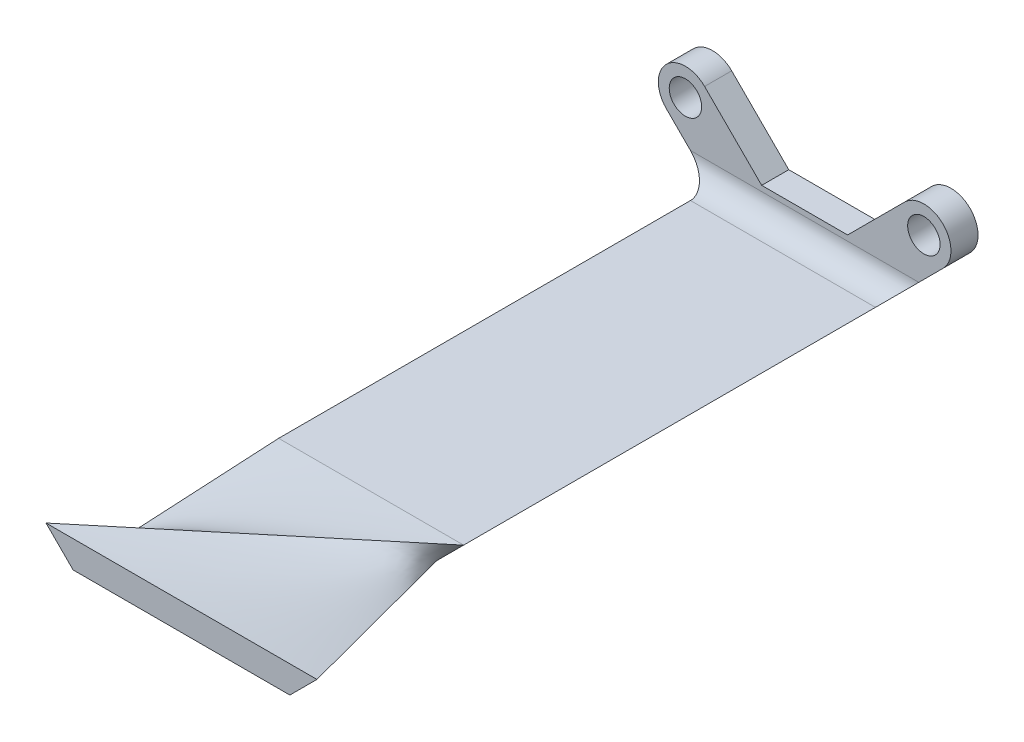
ISO-10303-21;
HEADER;
FILE_DESCRIPTION(('STEP AP214'),'2;1');
FILE_NAME('part.step','',(''),(''),'','','');
FILE_SCHEMA(('AUTOMOTIVE_DESIGN { 1 0 10303 214 1 1 1 1 }'));
ENDSEC;
DATA;
#1=APPLICATION_CONTEXT('core data for automotive mechanical design processes');
#2=APPLICATION_PROTOCOL_DEFINITION('international standard','automotive_design',2000,#1);
#3=PRODUCT_CONTEXT('',#1,'mechanical');
#4=PRODUCT('Part','Part','',(#3));
#5=PRODUCT_RELATED_PRODUCT_CATEGORY('part','',(#4));
#6=PRODUCT_DEFINITION_FORMATION('','',#4);
#7=PRODUCT_DEFINITION_CONTEXT('part definition',#1,'design');
#8=PRODUCT_DEFINITION('design','',#6,#7);
#9=PRODUCT_DEFINITION_SHAPE('','',#8);
#10=(LENGTH_UNIT() NAMED_UNIT(*) SI_UNIT(.MILLI.,.METRE.));
#11=(NAMED_UNIT(*) PLANE_ANGLE_UNIT() SI_UNIT($,.RADIAN.));
#12=(NAMED_UNIT(*) SI_UNIT($,.STERADIAN.) SOLID_ANGLE_UNIT());
#13=UNCERTAINTY_MEASURE_WITH_UNIT(LENGTH_MEASURE(1.E-05),#10,'distance_accuracy_value','');
#14=(GEOMETRIC_REPRESENTATION_CONTEXT(3) GLOBAL_UNCERTAINTY_ASSIGNED_CONTEXT((#13)) GLOBAL_UNIT_ASSIGNED_CONTEXT((#10,
#11,#12)) REPRESENTATION_CONTEXT('',''));
#15=CARTESIAN_POINT('',(0.,0.,0.));
#16=DIRECTION('',(0.,0.,1.));
#17=DIRECTION('',(1.,0.,0.));
#18=AXIS2_PLACEMENT_3D('',#15,#16,#17);
#19=CARTESIAN_POINT('',(0.,0.,3.175));
#20=DIRECTION('',(0.,0.,-1.));
#21=DIRECTION('',(-1.,0.,0.));
#22=AXIS2_PLACEMENT_3D('',#19,#20,#21);
#23=CYLINDRICAL_SURFACE('',#22,3.175);
#24=CARTESIAN_POINT('',(0.,0.,0.));
#25=DIRECTION('',(0.,0.,1.));
#26=DIRECTION('',(-1.,0.,0.));
#27=AXIS2_PLACEMENT_3D('',#24,#25,#26);
#28=CIRCLE('',#27,3.175);
#29=CARTESIAN_POINT('',(2.24506403026729,2.24506403026729,0.));
#30=VERTEX_POINT('',#29);
#31=CARTESIAN_POINT('',(-2.24506403026729,-2.24506403026729,0.));
#32=VERTEX_POINT('',#31);
#33=EDGE_CURVE('E90',#30,#32,#28,.T.);
#34=ORIENTED_EDGE('',*,*,#33,.T.);
#35=DIRECTION('',(0.,0.,-1.));
#36=VECTOR('',#35,1.);
#37=CARTESIAN_POINT('',(-2.24506403026729,-2.24506403026729,3.175));
#38=LINE('',#37,#36);
#39=CARTESIAN_POINT('',(-2.24506403026729,-2.24506403026729,3.175));
#40=VERTEX_POINT('',#39);
#41=EDGE_CURVE('E280',#40,#32,#38,.T.);
#42=ORIENTED_EDGE('',*,*,#41,.F.);
#43=CARTESIAN_POINT('',(0.,0.,3.175));
#44=DIRECTION('',(0.,0.,1.));
#45=DIRECTION('',(-1.,0.,0.));
#46=AXIS2_PLACEMENT_3D('',#43,#44,#45);
#47=CIRCLE('',#46,3.175);
#48=CARTESIAN_POINT('',(2.24506403026729,2.24506403026729,3.175));
#49=VERTEX_POINT('',#48);
#50=EDGE_CURVE('E267',#49,#40,#47,.T.);
#51=ORIENTED_EDGE('',*,*,#50,.F.);
#52=DIRECTION('',(0.,0.,-1.));
#53=VECTOR('',#52,1.);
#54=CARTESIAN_POINT('',(2.24506403026729,2.24506403026729,3.175));
#55=LINE('',#54,#53);
#56=EDGE_CURVE('E334',#49,#30,#55,.T.);
#57=ORIENTED_EDGE('',*,*,#56,.T.);
#58=EDGE_LOOP('',(#34,#42,#51,#57));
#59=FACE_BOUND('',#58,.T.);
#60=ADVANCED_FACE('F43',(#59),#23,.T.);
#61=CARTESIAN_POINT('',(-2.24506403026729,-2.24506403026729,3.175));
#62=DIRECTION('',(0.707106781186547,0.707106781186548,0.));
#63=DIRECTION('',(-0.707106781186548,0.707106781186547,0.));
#64=AXIS2_PLACEMENT_3D('',#61,#62,#63);
#65=PLANE('',#64);
#66=DIRECTION('',(0.707106781186548,-0.707106781186547,0.));
#67=VECTOR('',#66,1.);
#68=CARTESIAN_POINT('',(-2.24506403026729,-2.24506403026729,0.));
#69=LINE('',#68,#67);
#70=CARTESIAN_POINT('',(6.30487193946542,-10.795,0.));
#71=VERTEX_POINT('',#70);
#72=EDGE_CURVE('E308',#32,#71,#69,.T.);
#73=ORIENTED_EDGE('',*,*,#72,.T.);
#74=DIRECTION('',(0.,0.,-1.));
#75=VECTOR('',#74,1.);
#76=CARTESIAN_POINT('',(6.30487193946542,-10.795,3.175));
#77=LINE('',#76,#75);
#78=CARTESIAN_POINT('',(6.30487193946542,-10.795,53.975));
#79=VERTEX_POINT('',#78);
#80=EDGE_CURVE('E293',#79,#71,#77,.T.);
#81=ORIENTED_EDGE('',*,*,#80,.F.);
#82=DIRECTION('',(-0.707106781186548,0.707106781186547,0.));
#83=VECTOR('',#82,1.);
#84=CARTESIAN_POINT('',(-2.24506403026729,-2.24506403026729,53.975));
#85=LINE('',#84,#83);
#86=CARTESIAN_POINT('',(3.12987193946543,-7.62,53.975));
#87=VERTEX_POINT('',#86);
#88=EDGE_CURVE('E102',#87,#79,#85,.F.);
#89=ORIENTED_EDGE('',*,*,#88,.F.);
#90=DIRECTION('',(0.,0.,-1.));
#91=VECTOR('',#90,1.);
#92=CARTESIAN_POINT('',(3.12987193946543,-7.62,53.975));
#93=LINE('',#92,#91);
#94=CARTESIAN_POINT('',(3.12987193946543,-7.62,5.715));
#95=VERTEX_POINT('',#94);
#96=EDGE_CURVE('E91',#87,#95,#93,.T.);
#97=ORIENTED_EDGE('',*,*,#96,.T.);
#98=CARTESIAN_POINT('',(0.589871939465422,-5.08,5.715));
#99=DIRECTION('',(0.707106781186547,0.707106781186548,0.));
#100=DIRECTION('',(0.707106781186548,-0.707106781186547,0.));
#101=AXIS2_PLACEMENT_3D('',#98,#99,#100);
#102=ELLIPSE('',#101,3.59210244842766,2.54);
#103=CARTESIAN_POINT('',(0.589871939465422,-5.08,3.175));
#104=VERTEX_POINT('',#103);
#105=EDGE_CURVE('E12',#95,#104,#102,.T.);
#106=ORIENTED_EDGE('',*,*,#105,.T.);
#107=DIRECTION('',(0.707106781186548,-0.707106781186547,0.));
#108=VECTOR('',#107,1.);
#109=CARTESIAN_POINT('',(-2.24506403026729,-2.24506403026729,3.175));
#110=LINE('',#109,#108);
#111=EDGE_CURVE('E270',#40,#104,#110,.T.);
#112=ORIENTED_EDGE('',*,*,#111,.F.);
#113=ORIENTED_EDGE('',*,*,#41,.T.);
#114=EDGE_LOOP('',(#73,#81,#89,#97,#106,#112,#113));
#115=FACE_BOUND('',#114,.T.);
#116=ADVANCED_FACE('F303',(#115),#65,.F.);
#117=CARTESIAN_POINT('',(6.30487193946542,-10.795,3.175));
#118=DIRECTION('',(0.,1.,0.));
#119=DIRECTION('',(0.,0.,1.));
#120=AXIS2_PLACEMENT_3D('',#117,#118,#119);
#121=PLANE('',#120);
#122=DIRECTION('',(1.,0.,0.));
#123=VECTOR('',#122,1.);
#124=CARTESIAN_POINT('',(6.30487193946542,-10.795,0.));
#125=LINE('',#124,#123);
#126=CARTESIAN_POINT('',(21.6351280605346,-10.795,0.));
#127=VERTEX_POINT('',#126);
#128=EDGE_CURVE('E312',#71,#127,#125,.T.);
#129=ORIENTED_EDGE('',*,*,#128,.T.);
#130=DIRECTION('',(0.,0.,-1.));
#131=VECTOR('',#130,1.);
#132=CARTESIAN_POINT('',(21.6351280605346,-10.795,3.175));
#133=LINE('',#132,#131);
#134=CARTESIAN_POINT('',(21.6351280605346,-10.795,53.975));
#135=VERTEX_POINT('',#134);
#136=EDGE_CURVE('E80',#135,#127,#133,.T.);
#137=ORIENTED_EDGE('',*,*,#136,.F.);
#138=DIRECTION('',(1.,0.,0.));
#139=VECTOR('',#138,1.);
#140=CARTESIAN_POINT('',(6.30487193946542,-10.795,53.975));
#141=LINE('',#140,#139);
#142=EDGE_CURVE('E112',#79,#135,#141,.T.);
#143=ORIENTED_EDGE('',*,*,#142,.F.);
#144=ORIENTED_EDGE('',*,*,#80,.T.);
#145=EDGE_LOOP('',(#129,#137,#143,#144));
#146=FACE_BOUND('',#145,.T.);
#147=ADVANCED_FACE('F310',(#146),#121,.F.);
#148=CARTESIAN_POINT('',(21.6351280605346,-10.795,3.175));
#149=DIRECTION('',(-0.707106781186547,0.707106781186548,0.));
#150=DIRECTION('',(-0.707106781186548,-0.707106781186547,0.));
#151=AXIS2_PLACEMENT_3D('',#148,#149,#150);
#152=PLANE('',#151);
#153=DIRECTION('',(0.707106781186548,0.707106781186547,0.));
#154=VECTOR('',#153,1.);
#155=CARTESIAN_POINT('',(21.6351280605346,-10.795,0.));
#156=LINE('',#155,#154);
#157=CARTESIAN_POINT('',(30.1850640302673,-2.24506403026729,0.));
#158=VERTEX_POINT('',#157);
#159=EDGE_CURVE('E345',#127,#158,#156,.T.);
#160=ORIENTED_EDGE('',*,*,#159,.T.);
#161=DIRECTION('',(0.,0.,-1.));
#162=VECTOR('',#161,1.);
#163=CARTESIAN_POINT('',(30.1850640302673,-2.24506403026729,3.175));
#164=LINE('',#163,#162);
#165=CARTESIAN_POINT('',(30.1850640302673,-2.24506403026729,3.175));
#166=VERTEX_POINT('',#165);
#167=EDGE_CURVE('E297',#166,#158,#164,.T.);
#168=ORIENTED_EDGE('',*,*,#167,.F.);
#169=DIRECTION('',(0.707106781186548,0.707106781186547,0.));
#170=VECTOR('',#169,1.);
#171=CARTESIAN_POINT('',(21.6351280605346,-10.795,3.175));
#172=LINE('',#171,#170);
#173=CARTESIAN_POINT('',(27.3501280605346,-5.08,3.175));
#174=VERTEX_POINT('',#173);
#175=EDGE_CURVE('E279',#174,#166,#172,.T.);
#176=ORIENTED_EDGE('',*,*,#175,.F.);
#177=CARTESIAN_POINT('',(27.3501280605346,-5.08,5.715));
#178=DIRECTION('',(-0.707106781186547,0.707106781186548,0.));
#179=DIRECTION('',(0.707106781186548,0.707106781186547,0.));
#180=AXIS2_PLACEMENT_3D('',#177,#178,#179);
#181=ELLIPSE('',#180,3.59210244842766,2.54);
#182=CARTESIAN_POINT('',(24.8101280605346,-7.62,5.715));
#183=VERTEX_POINT('',#182);
#184=EDGE_CURVE('E53',#174,#183,#181,.T.);
#185=ORIENTED_EDGE('',*,*,#184,.T.);
#186=DIRECTION('',(0.,0.,-1.));
#187=VECTOR('',#186,1.);
#188=CARTESIAN_POINT('',(24.8101280605346,-7.62,53.975));
#189=LINE('',#188,#187);
#190=CARTESIAN_POINT('',(24.8101280605346,-7.62,53.975));
#191=VERTEX_POINT('',#190);
#192=EDGE_CURVE('E82',#191,#183,#189,.T.);
#193=ORIENTED_EDGE('',*,*,#192,.F.);
#194=DIRECTION('',(-0.707106781186548,-0.707106781186547,0.));
#195=VECTOR('',#194,1.);
#196=CARTESIAN_POINT('',(21.6351280605346,-10.795,53.975));
#197=LINE('',#196,#195);
#198=EDGE_CURVE('E47',#135,#191,#197,.F.);
#199=ORIENTED_EDGE('',*,*,#198,.F.);
#200=ORIENTED_EDGE('',*,*,#136,.T.);
#201=EDGE_LOOP('',(#160,#168,#176,#185,#193,#199,#200));
#202=FACE_BOUND('',#201,.T.);
#203=ADVANCED_FACE('F85',(#202),#152,.F.);
#204=CARTESIAN_POINT('',(27.94,0.,3.175));
#205=DIRECTION('',(0.,0.,-1.));
#206=DIRECTION('',(-1.,0.,0.));
#207=AXIS2_PLACEMENT_3D('',#204,#205,#206);
#208=CYLINDRICAL_SURFACE('',#207,3.175);
#209=CARTESIAN_POINT('',(27.94,0.,0.));
#210=DIRECTION('',(0.,0.,1.));
#211=DIRECTION('',(1.,0.,0.));
#212=AXIS2_PLACEMENT_3D('',#209,#210,#211);
#213=CIRCLE('',#212,3.175);
#214=CARTESIAN_POINT('',(25.6949359697327,2.24506403026729,0.));
#215=VERTEX_POINT('',#214);
#216=EDGE_CURVE('E347',#158,#215,#213,.T.);
#217=ORIENTED_EDGE('',*,*,#216,.T.);
#218=DIRECTION('',(0.,0.,-1.));
#219=VECTOR('',#218,1.);
#220=CARTESIAN_POINT('',(25.6949359697327,2.24506403026729,3.175));
#221=LINE('',#220,#219);
#222=CARTESIAN_POINT('',(25.6949359697327,2.24506403026729,3.175));
#223=VERTEX_POINT('',#222);
#224=EDGE_CURVE('E365',#223,#215,#221,.T.);
#225=ORIENTED_EDGE('',*,*,#224,.F.);
#226=CARTESIAN_POINT('',(27.94,0.,3.175));
#227=DIRECTION('',(0.,0.,1.));
#228=DIRECTION('',(1.,0.,0.));
#229=AXIS2_PLACEMENT_3D('',#226,#227,#228);
#230=CIRCLE('',#229,3.175);
#231=EDGE_CURVE('E286',#166,#223,#230,.T.);
#232=ORIENTED_EDGE('',*,*,#231,.F.);
#233=ORIENTED_EDGE('',*,*,#167,.T.);
#234=EDGE_LOOP('',(#217,#225,#232,#233));
#235=FACE_BOUND('',#234,.T.);
#236=ADVANCED_FACE('F319',(#235),#208,.T.);
#237=CARTESIAN_POINT('',(19.0048719394654,-4.445,3.175));
#238=DIRECTION('',(0.707106781186548,-0.707106781186547,0.));
#239=DIRECTION('',(0.707106781186547,0.707106781186548,0.));
#240=AXIS2_PLACEMENT_3D('',#237,#238,#239);
#241=PLANE('',#240);
#242=DIRECTION('',(-0.707106781186547,-0.707106781186548,0.));
#243=VECTOR('',#242,1.);
#244=CARTESIAN_POINT('',(19.0048719394654,-4.445,0.));
#245=LINE('',#244,#243);
#246=CARTESIAN_POINT('',(19.0048719394654,-4.445,0.));
#247=VERTEX_POINT('',#246);
#248=EDGE_CURVE('E350',#215,#247,#245,.T.);
#249=ORIENTED_EDGE('',*,*,#248,.T.);
#250=DIRECTION('',(0.,0.,-1.));
#251=VECTOR('',#250,1.);
#252=CARTESIAN_POINT('',(19.0048719394654,-4.445,3.175));
#253=LINE('',#252,#251);
#254=CARTESIAN_POINT('',(19.0048719394654,-4.445,3.175));
#255=VERTEX_POINT('',#254);
#256=EDGE_CURVE('E362',#255,#247,#253,.T.);
#257=ORIENTED_EDGE('',*,*,#256,.F.);
#258=DIRECTION('',(-0.707106781186547,-0.707106781186548,0.));
#259=VECTOR('',#258,1.);
#260=CARTESIAN_POINT('',(19.0048719394654,-4.445,3.175));
#261=LINE('',#260,#259);
#262=EDGE_CURVE('E404',#223,#255,#261,.T.);
#263=ORIENTED_EDGE('',*,*,#262,.F.);
#264=ORIENTED_EDGE('',*,*,#224,.T.);
#265=EDGE_LOOP('',(#249,#257,#263,#264));
#266=FACE_BOUND('',#265,.T.);
#267=ADVANCED_FACE('F386',(#266),#241,.F.);
#268=CARTESIAN_POINT('',(8.93512806053458,-4.445,3.175));
#269=DIRECTION('',(0.,-1.,0.));
#270=DIRECTION('',(0.,0.,-1.));
#271=AXIS2_PLACEMENT_3D('',#268,#269,#270);
#272=PLANE('',#271);
#273=DIRECTION('',(-1.,0.,0.));
#274=VECTOR('',#273,1.);
#275=CARTESIAN_POINT('',(8.93512806053458,-4.445,0.));
#276=LINE('',#275,#274);
#277=CARTESIAN_POINT('',(8.93512806053458,-4.445,0.));
#278=VERTEX_POINT('',#277);
#279=EDGE_CURVE('E353',#247,#278,#276,.T.);
#280=ORIENTED_EDGE('',*,*,#279,.T.);
#281=DIRECTION('',(0.,0.,-1.));
#282=VECTOR('',#281,1.);
#283=CARTESIAN_POINT('',(8.93512806053458,-4.445,3.175));
#284=LINE('',#283,#282);
#285=CARTESIAN_POINT('',(8.93512806053458,-4.445,3.175));
#286=VERTEX_POINT('',#285);
#287=EDGE_CURVE('E359',#286,#278,#284,.T.);
#288=ORIENTED_EDGE('',*,*,#287,.F.);
#289=DIRECTION('',(-1.,0.,0.));
#290=VECTOR('',#289,1.);
#291=CARTESIAN_POINT('',(8.93512806053458,-4.445,3.175));
#292=LINE('',#291,#290);
#293=EDGE_CURVE('E396',#255,#286,#292,.T.);
#294=ORIENTED_EDGE('',*,*,#293,.F.);
#295=ORIENTED_EDGE('',*,*,#256,.T.);
#296=EDGE_LOOP('',(#280,#288,#294,#295));
#297=FACE_BOUND('',#296,.T.);
#298=ADVANCED_FACE('F393',(#297),#272,.F.);
#299=CARTESIAN_POINT('',(2.24506403026729,2.24506403026729,3.175));
#300=DIRECTION('',(-0.707106781186548,-0.707106781186548,0.));
#301=DIRECTION('',(0.707106781186548,-0.707106781186548,0.));
#302=AXIS2_PLACEMENT_3D('',#299,#300,#301);
#303=PLANE('',#302);
#304=DIRECTION('',(-0.707106781186547,0.707106781186547,0.));
#305=VECTOR('',#304,1.);
#306=CARTESIAN_POINT('',(2.24506403026729,2.24506403026729,0.));
#307=LINE('',#306,#305);
#308=EDGE_CURVE('E271',#278,#30,#307,.T.);
#309=ORIENTED_EDGE('',*,*,#308,.T.);
#310=ORIENTED_EDGE('',*,*,#56,.F.);
#311=DIRECTION('',(-0.707106781186547,0.707106781186547,0.));
#312=VECTOR('',#311,1.);
#313=CARTESIAN_POINT('',(2.24506403026729,2.24506403026729,3.175));
#314=LINE('',#313,#312);
#315=EDGE_CURVE('E341',#286,#49,#314,.T.);
#316=ORIENTED_EDGE('',*,*,#315,.F.);
#317=ORIENTED_EDGE('',*,*,#287,.T.);
#318=EDGE_LOOP('',(#309,#310,#316,#317));
#319=FACE_BOUND('',#318,.T.);
#320=ADVANCED_FACE('F427',(#319),#303,.F.);
#321=CARTESIAN_POINT('',(0.,0.,3.175));
#322=DIRECTION('',(0.,0.,-1.));
#323=DIRECTION('',(-1.,0.,0.));
#324=AXIS2_PLACEMENT_3D('',#321,#322,#323);
#325=PLANE('',#324);
#326=CARTESIAN_POINT('',(27.94,0.,3.175));
#327=DIRECTION('',(0.,0.,-1.));
#328=DIRECTION('',(-1.,0.,0.));
#329=AXIS2_PLACEMENT_3D('',#326,#327,#328);
#330=CIRCLE('',#329,1.89864999999999);
#331=CARTESIAN_POINT('',(26.04135,0.,3.175));
#332=VERTEX_POINT('',#331);
#333=EDGE_CURVE('E258',#332,#332,#330,.T.);
#334=ORIENTED_EDGE('',*,*,#333,.T.);
#335=EDGE_LOOP('',(#334));
#336=FACE_BOUND('',#335,.T.);
#337=CARTESIAN_POINT('',(0.,0.,3.175));
#338=DIRECTION('',(0.,0.,-1.));
#339=DIRECTION('',(-1.,0.,0.));
#340=AXIS2_PLACEMENT_3D('',#337,#338,#339);
#341=CIRCLE('',#340,1.89864999999999);
#342=CARTESIAN_POINT('',(-1.89864999999999,0.,3.175));
#343=VERTEX_POINT('',#342);
#344=EDGE_CURVE('E264',#343,#343,#341,.T.);
#345=ORIENTED_EDGE('',*,*,#344,.T.);
#346=EDGE_LOOP('',(#345));
#347=FACE_BOUND('',#346,.T.);
#348=ORIENTED_EDGE('',*,*,#111,.T.);
#349=DIRECTION('',(1.,0.,0.));
#350=VECTOR('',#349,1.);
#351=CARTESIAN_POINT('',(0.,-5.08,3.175));
#352=LINE('',#351,#350);
#353=EDGE_CURVE('E287',#104,#174,#352,.T.);
#354=ORIENTED_EDGE('',*,*,#353,.T.);
#355=ORIENTED_EDGE('',*,*,#175,.T.);
#356=ORIENTED_EDGE('',*,*,#231,.T.);
#357=ORIENTED_EDGE('',*,*,#262,.T.);
#358=ORIENTED_EDGE('',*,*,#293,.T.);
#359=ORIENTED_EDGE('',*,*,#315,.T.);
#360=ORIENTED_EDGE('',*,*,#50,.T.);
#361=EDGE_LOOP('',(#348,#354,#355,#356,#357,#358,#359,#360));
#362=FACE_BOUND('',#361,.T.);
#363=ADVANCED_FACE('F406',(#336,#347,#362),#325,.F.);
#364=CARTESIAN_POINT('',(0.,0.,0.));
#365=DIRECTION('',(0.,0.,-1.));
#366=DIRECTION('',(-1.,0.,0.));
#367=AXIS2_PLACEMENT_3D('',#364,#365,#366);
#368=PLANE('',#367);
#369=CARTESIAN_POINT('',(27.94,0.,0.));
#370=DIRECTION('',(0.,0.,-1.));
#371=DIRECTION('',(-1.,0.,0.));
#372=AXIS2_PLACEMENT_3D('',#369,#370,#371);
#373=CIRCLE('',#372,1.89864999999999);
#374=CARTESIAN_POINT('',(26.04135,0.,0.));
#375=VERTEX_POINT('',#374);
#376=EDGE_CURVE('E250',#375,#375,#373,.T.);
#377=ORIENTED_EDGE('',*,*,#376,.F.);
#378=EDGE_LOOP('',(#377));
#379=FACE_BOUND('',#378,.T.);
#380=CARTESIAN_POINT('',(0.,0.,0.));
#381=DIRECTION('',(0.,0.,-1.));
#382=DIRECTION('',(-1.,0.,0.));
#383=AXIS2_PLACEMENT_3D('',#380,#381,#382);
#384=CIRCLE('',#383,1.89864999999999);
#385=CARTESIAN_POINT('',(-1.89864999999999,0.,0.));
#386=VERTEX_POINT('',#385);
#387=EDGE_CURVE('E261',#386,#386,#384,.T.);
#388=ORIENTED_EDGE('',*,*,#387,.F.);
#389=EDGE_LOOP('',(#388));
#390=FACE_BOUND('',#389,.T.);
#391=ORIENTED_EDGE('',*,*,#33,.F.);
#392=ORIENTED_EDGE('',*,*,#308,.F.);
#393=ORIENTED_EDGE('',*,*,#279,.F.);
#394=ORIENTED_EDGE('',*,*,#248,.F.);
#395=ORIENTED_EDGE('',*,*,#216,.F.);
#396=ORIENTED_EDGE('',*,*,#159,.F.);
#397=ORIENTED_EDGE('',*,*,#128,.F.);
#398=ORIENTED_EDGE('',*,*,#72,.F.);
#399=EDGE_LOOP('',(#391,#392,#393,#394,#395,#396,#397,#398));
#400=FACE_BOUND('',#399,.T.);
#401=ADVANCED_FACE('F380',(#379,#390,#400),#368,.T.);
#402=CARTESIAN_POINT('',(13.97,-7.62,53.975));
#403=DIRECTION('',(0.,1.,0.));
#404=DIRECTION('',(0.,0.,1.));
#405=AXIS2_PLACEMENT_3D('',#402,#403,#404);
#406=PLANE('',#405);
#407=ORIENTED_EDGE('',*,*,#192,.T.);
#408=DIRECTION('',(1.,0.,0.));
#409=VECTOR('',#408,1.);
#410=CARTESIAN_POINT('',(13.97,-7.62,5.715));
#411=LINE('',#410,#409);
#412=EDGE_CURVE('E290',#183,#95,#411,.F.);
#413=ORIENTED_EDGE('',*,*,#412,.T.);
#414=ORIENTED_EDGE('',*,*,#96,.F.);
#415=DIRECTION('',(1.,0.,0.));
#416=VECTOR('',#415,1.);
#417=CARTESIAN_POINT('',(13.97,-7.62,53.975));
#418=LINE('',#417,#416);
#419=EDGE_CURVE('E94',#87,#191,#418,.T.);
#420=ORIENTED_EDGE('',*,*,#419,.T.);
#421=EDGE_LOOP('',(#407,#413,#414,#420));
#422=FACE_BOUND('',#421,.T.);
#423=ADVANCED_FACE('F95',(#422),#406,.T.);
#424=CARTESIAN_POINT('',(0.,-5.08,5.715));
#425=DIRECTION('',(1.,0.,0.));
#426=DIRECTION('',(0.,0.,-1.));
#427=AXIS2_PLACEMENT_3D('',#424,#425,#426);
#428=CYLINDRICAL_SURFACE('',#427,2.54);
#429=ORIENTED_EDGE('',*,*,#105,.F.);
#430=ORIENTED_EDGE('',*,*,#412,.F.);
#431=ORIENTED_EDGE('',*,*,#184,.F.);
#432=ORIENTED_EDGE('',*,*,#353,.F.);
#433=EDGE_LOOP('',(#429,#430,#431,#432));
#434=FACE_BOUND('',#433,.T.);
#435=ADVANCED_FACE('F45',(#434),#428,.F.);
#436=CARTESIAN_POINT('',(0.,0.,0.));
#437=DIRECTION('',(0.,0.,-1.));
#438=DIRECTION('',(-1.,0.,0.));
#439=AXIS2_PLACEMENT_3D('',#436,#437,#438);
#440=CYLINDRICAL_SURFACE('',#439,1.89864999999999);
#441=ORIENTED_EDGE('',*,*,#387,.T.);
#442=EDGE_LOOP('',(#441));
#443=FACE_BOUND('',#442,.T.);
#444=ORIENTED_EDGE('',*,*,#344,.F.);
#445=EDGE_LOOP('',(#444));
#446=FACE_BOUND('',#445,.T.);
#447=ADVANCED_FACE('F468',(#443,#446),#440,.F.);
#448=CARTESIAN_POINT('',(27.94,0.,0.));
#449=DIRECTION('',(0.,0.,-1.));
#450=DIRECTION('',(-1.,0.,0.));
#451=AXIS2_PLACEMENT_3D('',#448,#449,#450);
#452=CYLINDRICAL_SURFACE('',#451,1.89864999999999);
#453=ORIENTED_EDGE('',*,*,#376,.T.);
#454=EDGE_LOOP('',(#453));
#455=FACE_BOUND('',#454,.T.);
#456=ORIENTED_EDGE('',*,*,#333,.F.);
#457=EDGE_LOOP('',(#456));
#458=FACE_BOUND('',#457,.T.);
#459=ADVANCED_FACE('F224',(#455,#458),#452,.F.);
#460=CARTESIAN_POINT('',(13.97,-23.495,76.2));
#461=DIRECTION('',(0.,0.,-1.));
#462=DIRECTION('',(-1.,0.,0.));
#463=AXIS2_PLACEMENT_3D('',#460,#461,#462);
#464=PLANE('',#463);
#465=DIRECTION('',(0.707106781186547,-0.707106781186547,0.));
#466=VECTOR('',#465,1.);
#467=CARTESIAN_POINT('',(-1.905,-7.62,76.2));
#468=LINE('',#467,#466);
#469=CARTESIAN_POINT('',(-1.905,-7.62,76.2));
#470=VERTEX_POINT('',#469);
#471=CARTESIAN_POINT('',(1.27,-10.795,76.2));
#472=VERTEX_POINT('',#471);
#473=EDGE_CURVE('E116',#470,#472,#468,.T.);
#474=ORIENTED_EDGE('',*,*,#473,.T.);
#475=DIRECTION('',(1.,0.,0.));
#476=VECTOR('',#475,1.);
#477=CARTESIAN_POINT('',(1.27,-10.795,76.2));
#478=LINE('',#477,#476);
#479=CARTESIAN_POINT('',(26.67,-10.795,76.2));
#480=VERTEX_POINT('',#479);
#481=EDGE_CURVE('E238',#472,#480,#478,.T.);
#482=ORIENTED_EDGE('',*,*,#481,.T.);
#483=DIRECTION('',(0.707106781186547,0.707106781186547,0.));
#484=VECTOR('',#483,1.);
#485=CARTESIAN_POINT('',(29.845,-7.62,76.2));
#486=LINE('',#485,#484);
#487=CARTESIAN_POINT('',(29.845,-7.62,76.2));
#488=VERTEX_POINT('',#487);
#489=EDGE_CURVE('E189',#480,#488,#486,.T.);
#490=ORIENTED_EDGE('',*,*,#489,.T.);
#491=DIRECTION('',(-1.,0.,0.));
#492=VECTOR('',#491,1.);
#493=CARTESIAN_POINT('',(-1.905,-7.62,76.2));
#494=LINE('',#493,#492);
#495=EDGE_CURVE('E123',#488,#470,#494,.T.);
#496=ORIENTED_EDGE('',*,*,#495,.T.);
#497=EDGE_LOOP('',(#474,#482,#490,#496));
#498=FACE_BOUND('',#497,.T.);
#499=ADVANCED_FACE('F215',(#498),#464,.F.);
#500=CARTESIAN_POINT('',(6.30487193946542,-10.795,53.975));
#501=CARTESIAN_POINT('',(26.67,-10.795,76.2));
#502=CARTESIAN_POINT('',(8.85991462631028,-10.795,53.975));
#503=CARTESIAN_POINT('',(27.1991666666667,-10.2658333333333,76.2));
#504=CARTESIAN_POINT('',(11.4149573131551,-10.795,53.975));
#505=CARTESIAN_POINT('',(27.7283333333333,-9.73666666666666,76.2));
#506=CARTESIAN_POINT('',(16.5250426868449,-10.795,53.975));
#507=CARTESIAN_POINT('',(28.7866666666667,-8.67833333333333,76.2));
#508=CARTESIAN_POINT('',(19.0800853736897,-10.795,53.975));
#509=CARTESIAN_POINT('',(29.3158333333333,-8.14916666666666,76.2));
#510=CARTESIAN_POINT('',(21.6351280605346,-10.795,53.975));
#511=CARTESIAN_POINT('',(29.845,-7.62,76.2));
#512=B_SPLINE_SURFACE_WITH_KNOTS('',3,1,((#500,#501),(#502,#503),(#504,#505),(#506,#507),(#508,
#509),(#510,#511)),.UNSPECIFIED.,.F.,.F.,.F.,(4,2,4),(2,2),(0.,0.5,1.),(0.,1.),.UNSPECIFIED.);
#513=DIRECTION('',(0.343442178594856,0.132819235802802,0.929734650619616));
#514=VECTOR('',#513,1.);
#515=CARTESIAN_POINT('',(25.7400640302673,-9.2075,65.0875));
#516=LINE('',#515,#514);
#517=EDGE_CURVE('E111',#135,#488,#516,.T.);
#518=DIRECTION('',(-0.675584215743293,0.,-0.737282827304773));
#519=VECTOR('',#518,1.);
#520=CARTESIAN_POINT('',(16.4874359697327,-10.795,65.0875));
#521=LINE('',#520,#519);
#522=EDGE_CURVE('E118',#480,#79,#521,.T.);
#523=ORIENTED_EDGE('',*,*,#142,.T.);
#524=ORIENTED_EDGE('',*,*,#517,.T.);
#525=ORIENTED_EDGE('',*,*,#489,.F.);
#526=ORIENTED_EDGE('',*,*,#522,.T.);
#527=EDGE_LOOP('',(#523,#524,#525,#526));
#528=FACE_BOUND('',#527,.T.);
#529=ADVANCED_FACE('F151',(#528),#512,.T.);
#530=CARTESIAN_POINT('',(21.6351280605346,-10.795,53.975));
#531=CARTESIAN_POINT('',(29.845,-7.62,76.2));
#532=CARTESIAN_POINT('',(22.1642947272012,-10.2658333333333,53.975));
#533=CARTESIAN_POINT('',(24.5533333333333,-7.62,76.2));
#534=CARTESIAN_POINT('',(22.6934613938679,-9.73666666666667,53.975));
#535=CARTESIAN_POINT('',(19.2616666666666,-7.62,76.2));
#536=CARTESIAN_POINT('',(23.7517947272012,-8.67833333333333,53.975));
#537=CARTESIAN_POINT('',(8.67833333333324,-7.62,76.2));
#538=CARTESIAN_POINT('',(24.2809613938679,-8.14916666666667,53.975));
#539=CARTESIAN_POINT('',(3.3866666666666,-7.62,76.2));
#540=CARTESIAN_POINT('',(24.8101280605346,-7.62,53.975));
#541=CARTESIAN_POINT('',(-1.905,-7.62,76.2));
#542=B_SPLINE_SURFACE_WITH_KNOTS('',3,1,((#530,#531),(#532,#533),(#534,#535),(#536,#537),(#538,
#539),(#540,#541)),.UNSPECIFIED.,.F.,.F.,.F.,(4,2,4),(2,2),(0.,0.5,1.),(0.,1.),.UNSPECIFIED.);
#543=DIRECTION('',(-0.768753228419935,0.,0.639545521283613));
#544=VECTOR('',#543,1.);
#545=CARTESIAN_POINT('',(11.4525640302673,-7.62,65.0875));
#546=LINE('',#545,#544);
#547=EDGE_CURVE('E109',#191,#470,#546,.T.);
#548=ORIENTED_EDGE('',*,*,#198,.T.);
#549=ORIENTED_EDGE('',*,*,#547,.T.);
#550=ORIENTED_EDGE('',*,*,#495,.F.);
#551=ORIENTED_EDGE('',*,*,#517,.F.);
#552=EDGE_LOOP('',(#548,#549,#550,#551));
#553=FACE_BOUND('',#552,.T.);
#554=ADVANCED_FACE('F106',(#553),#542,.T.);
#555=CARTESIAN_POINT('',(3.12987193946543,-7.62,53.975));
#556=CARTESIAN_POINT('',(1.27,-10.795,76.2));
#557=CARTESIAN_POINT('',(3.65903860613209,-8.14916666666666,53.975));
#558=CARTESIAN_POINT('',(5.50333333333333,-10.795,76.2));
#559=CARTESIAN_POINT('',(4.18820527279876,-8.67833333333333,53.975));
#560=CARTESIAN_POINT('',(9.73666666666666,-10.795,76.2));
#561=CARTESIAN_POINT('',(5.24653860613209,-9.73666666666666,53.975));
#562=CARTESIAN_POINT('',(18.2033333333333,-10.795,76.2));
#563=CARTESIAN_POINT('',(5.77570527279876,-10.2658333333333,53.975));
#564=CARTESIAN_POINT('',(22.4366666666667,-10.795,76.2));
#565=CARTESIAN_POINT('',(6.30487193946543,-10.795,53.975));
#566=CARTESIAN_POINT('',(26.67,-10.795,76.2));
#567=B_SPLINE_SURFACE_WITH_KNOTS('',3,1,((#555,#556),(#557,#558),(#559,#560),(#561,#562),(#563,
#564),(#565,#566)),.UNSPECIFIED.,.F.,.F.,.F.,(4,2,4),(2,2),(0.,0.5,1.),(0.,1.),.UNSPECIFIED.);
#568=DIRECTION('',(-0.0825598961059941,-0.140938558496599,0.986569909476195));
#569=VECTOR('',#568,1.);
#570=CARTESIAN_POINT('',(2.19993596973271,-9.2075,65.0875));
#571=LINE('',#570,#569);
#572=EDGE_CURVE('E119',#87,#472,#571,.T.);
#573=ORIENTED_EDGE('',*,*,#88,.T.);
#574=ORIENTED_EDGE('',*,*,#522,.F.);
#575=ORIENTED_EDGE('',*,*,#481,.F.);
#576=ORIENTED_EDGE('',*,*,#572,.F.);
#577=EDGE_LOOP('',(#573,#574,#575,#576));
#578=FACE_BOUND('',#577,.T.);
#579=ADVANCED_FACE('F150',(#578),#567,.T.);
#580=CARTESIAN_POINT('',(24.8101280605346,-7.62,53.975));
#581=CARTESIAN_POINT('',(-1.905,-7.62,76.2));
#582=CARTESIAN_POINT('',(21.1967520403564,-7.62,53.975));
#583=CARTESIAN_POINT('',(-1.37583333333333,-8.14916666666667,76.2));
#584=CARTESIAN_POINT('',(17.5833760201782,-7.62,53.975));
#585=CARTESIAN_POINT('',(-0.846666666666661,-8.67833333333334,76.2));
#586=CARTESIAN_POINT('',(10.3566239798218,-7.62,53.975));
#587=CARTESIAN_POINT('',(0.211666666666672,-9.73666666666667,76.2));
#588=CARTESIAN_POINT('',(6.74324795964361,-7.62,53.975));
#589=CARTESIAN_POINT('',(0.740833333333337,-10.2658333333333,76.2));
#590=CARTESIAN_POINT('',(3.12987193946543,-7.62,53.975));
#591=CARTESIAN_POINT('',(1.27,-10.795,76.2));
#592=B_SPLINE_SURFACE_WITH_KNOTS('',3,1,((#580,#581),(#582,#583),(#584,#585),(#586,#587),(#588,
#589),(#590,#591)),.UNSPECIFIED.,.F.,.F.,.F.,(4,2,4),(2,2),(0.,0.5,1.),(0.,1.),.UNSPECIFIED.);
#593=ORIENTED_EDGE('',*,*,#419,.F.);
#594=ORIENTED_EDGE('',*,*,#572,.T.);
#595=ORIENTED_EDGE('',*,*,#473,.F.);
#596=ORIENTED_EDGE('',*,*,#547,.F.);
#597=EDGE_LOOP('',(#593,#594,#595,#596));
#598=FACE_BOUND('',#597,.T.);
#599=ADVANCED_FACE('F114',(#598),#592,.T.);
#600=CLOSED_SHELL('',(#60,#116,#147,#203,#236,#267,#298,#320,#363,#401,#423,#435,#447,#459,#499,
#529,#554,#579,#599));
#601=MANIFOLD_SOLID_BREP('B2',#600);
#602=ADVANCED_BREP_SHAPE_REPRESENTATION('',(#18,#601),#14);
#603=SHAPE_DEFINITION_REPRESENTATION(#9,#602);
ENDSEC;
END-ISO-10303-21;
